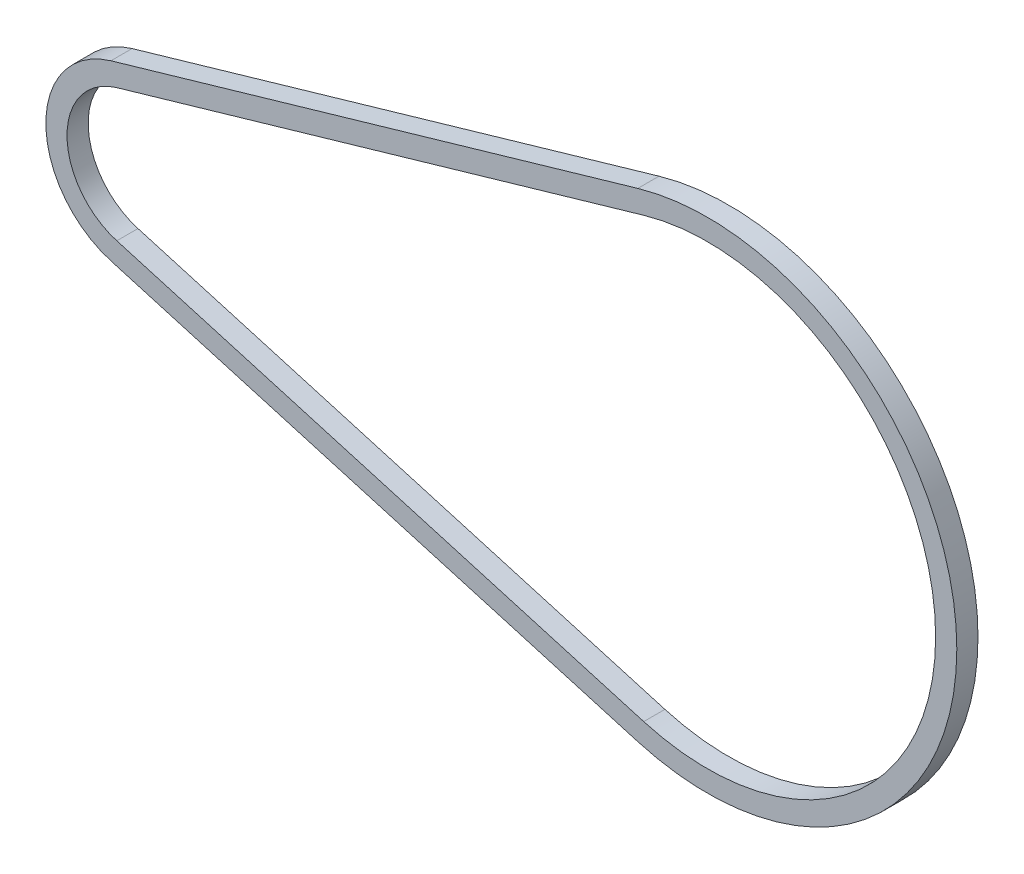
ISO-10303-21;
HEADER;
FILE_DESCRIPTION(('STEP AP214'),'2;1');
FILE_NAME('part.step','',(''),(''),'','','');
FILE_SCHEMA(('AUTOMOTIVE_DESIGN { 1 0 10303 214 1 1 1 1 }'));
ENDSEC;
DATA;
#1=APPLICATION_CONTEXT('core data for automotive mechanical design processes');
#2=APPLICATION_PROTOCOL_DEFINITION('international standard','automotive_design',2000,#1);
#3=PRODUCT_CONTEXT('',#1,'mechanical');
#4=PRODUCT('Part','Part','',(#3));
#5=PRODUCT_RELATED_PRODUCT_CATEGORY('part','',(#4));
#6=PRODUCT_DEFINITION_FORMATION('','',#4);
#7=PRODUCT_DEFINITION_CONTEXT('part definition',#1,'design');
#8=PRODUCT_DEFINITION('design','',#6,#7);
#9=PRODUCT_DEFINITION_SHAPE('','',#8);
#10=(LENGTH_UNIT() NAMED_UNIT(*) SI_UNIT(.MILLI.,.METRE.));
#11=(NAMED_UNIT(*) PLANE_ANGLE_UNIT() SI_UNIT($,.RADIAN.));
#12=(NAMED_UNIT(*) SI_UNIT($,.STERADIAN.) SOLID_ANGLE_UNIT());
#13=UNCERTAINTY_MEASURE_WITH_UNIT(LENGTH_MEASURE(1.E-05),#10,'distance_accuracy_value','');
#14=(GEOMETRIC_REPRESENTATION_CONTEXT(3) GLOBAL_UNCERTAINTY_ASSIGNED_CONTEXT((#13)) GLOBAL_UNIT_ASSIGNED_CONTEXT((#10,
#11,#12)) REPRESENTATION_CONTEXT('',''));
#15=CARTESIAN_POINT('',(0.,0.,0.));
#16=DIRECTION('',(0.,0.,1.));
#17=DIRECTION('',(1.,0.,0.));
#18=AXIS2_PLACEMENT_3D('',#15,#16,#17);
#19=CARTESIAN_POINT('',(0.,0.,1.27));
#20=DIRECTION('',(0.,0.,1.));
#21=DIRECTION('',(1.,0.,0.));
#22=AXIS2_PLACEMENT_3D('',#19,#20,#21);
#23=PLANE('',#22);
#24=CARTESIAN_POINT('',(0.,0.,1.27));
#25=DIRECTION('',(0.,0.,1.));
#26=DIRECTION('',(1.,0.,0.));
#27=AXIS2_PLACEMENT_3D('',#24,#25,#26);
#28=CIRCLE('',#27,10.8192968910912);
#29=CARTESIAN_POINT('',(-3.01580148803557,10.3904825009399,1.27));
#30=VERTEX_POINT('',#29);
#31=CARTESIAN_POINT('',(-3.01580148803557,-10.3904825009399,1.27));
#32=VERTEX_POINT('',#31);
#33=EDGE_CURVE('E177',#30,#32,#28,.T.);
#34=ORIENTED_EDGE('',*,*,#33,.T.);
#35=DIRECTION('',(0.960365780284263,-0.278742834991323,0.));
#36=VECTOR('',#35,1.);
#37=CARTESIAN_POINT('',(-3.01580148803557,-10.3904825009399,1.27));
#38=LINE('',#37,#36);
#39=CARTESIAN_POINT('',(60.1774981442526,-28.7321184208977,1.27));
#40=VERTEX_POINT('',#39);
#41=EDGE_CURVE('E181',#32,#40,#38,.T.);
#42=ORIENTED_EDGE('',*,*,#41,.T.);
#43=CARTESIAN_POINT('',(68.5168958074813,0.,1.27));
#44=DIRECTION('',(0.,0.,1.));
#45=DIRECTION('',(1.,0.,0.));
#46=AXIS2_PLACEMENT_3D('',#43,#44,#45);
#47=CIRCLE('',#46,29.9178906732736);
#48=CARTESIAN_POINT('',(60.1774981442526,28.7321184208977,1.27));
#49=VERTEX_POINT('',#48);
#50=EDGE_CURVE('E185',#40,#49,#47,.T.);
#51=ORIENTED_EDGE('',*,*,#50,.T.);
#52=DIRECTION('',(-0.960365780284263,-0.278742834991323,0.));
#53=VECTOR('',#52,1.);
#54=CARTESIAN_POINT('',(-3.01580148803557,10.3904825009399,1.27));
#55=LINE('',#54,#53);
#56=EDGE_CURVE('E188',#49,#30,#55,.T.);
#57=ORIENTED_EDGE('',*,*,#56,.T.);
#58=EDGE_LOOP('',(#34,#42,#51,#57));
#59=FACE_BOUND('',#58,.T.);
#60=DIRECTION('',(0.960365780284263,-0.278742834991323,0.));
#61=VECTOR('',#60,1.);
#62=CARTESIAN_POINT('',(-2.30779468715761,-7.95115341901787,1.27));
#63=LINE('',#62,#61);
#64=CARTESIAN_POINT('',(-2.30779468715761,-7.95115341901787,1.27));
#65=VERTEX_POINT('',#64);
#66=CARTESIAN_POINT('',(60.8855049451305,-26.2927893389757,1.27));
#67=VERTEX_POINT('',#66);
#68=EDGE_CURVE('E138',#65,#67,#63,.T.);
#69=ORIENTED_EDGE('',*,*,#68,.F.);
#70=CARTESIAN_POINT('',(0.,0.,1.27));
#71=DIRECTION('',(0.,0.,1.));
#72=DIRECTION('',(1.,0.,0.));
#73=AXIS2_PLACEMENT_3D('',#70,#71,#72);
#74=CIRCLE('',#73,8.2792968910912);
#75=CARTESIAN_POINT('',(-2.30779468715761,7.95115341901787,1.27));
#76=VERTEX_POINT('',#75);
#77=EDGE_CURVE('E129',#76,#65,#74,.T.);
#78=ORIENTED_EDGE('',*,*,#77,.F.);
#79=DIRECTION('',(-0.960365780284263,-0.278742834991323,0.));
#80=VECTOR('',#79,1.);
#81=CARTESIAN_POINT('',(-2.30779468715761,7.95115341901787,1.27));
#82=LINE('',#81,#80);
#83=CARTESIAN_POINT('',(60.8855049451305,26.2927893389757,1.27));
#84=VERTEX_POINT('',#83);
#85=EDGE_CURVE('E155',#84,#76,#82,.T.);
#86=ORIENTED_EDGE('',*,*,#85,.F.);
#87=CARTESIAN_POINT('',(68.5168958074813,0.,1.27));
#88=DIRECTION('',(0.,0.,1.));
#89=DIRECTION('',(1.,0.,0.));
#90=AXIS2_PLACEMENT_3D('',#87,#88,#89);
#91=CIRCLE('',#90,27.3778906732736);
#92=EDGE_CURVE('E151',#67,#84,#91,.T.);
#93=ORIENTED_EDGE('',*,*,#92,.F.);
#94=EDGE_LOOP('',(#69,#78,#86,#93));
#95=FACE_BOUND('',#94,.T.);
#96=ADVANCED_FACE('F63',(#59,#95),#23,.T.);
#97=CARTESIAN_POINT('',(0.,0.,-1.27));
#98=DIRECTION('',(0.,0.,1.));
#99=DIRECTION('',(1.,0.,0.));
#100=AXIS2_PLACEMENT_3D('',#97,#98,#99);
#101=PLANE('',#100);
#102=CARTESIAN_POINT('',(0.,0.,-1.27));
#103=DIRECTION('',(0.,0.,1.));
#104=DIRECTION('',(1.,0.,0.));
#105=AXIS2_PLACEMENT_3D('',#102,#103,#104);
#106=CIRCLE('',#105,10.8192968910912);
#107=CARTESIAN_POINT('',(-3.01580148803557,10.3904825009399,-1.27));
#108=VERTEX_POINT('',#107);
#109=CARTESIAN_POINT('',(-3.01580148803557,-10.3904825009399,-1.27));
#110=VERTEX_POINT('',#109);
#111=EDGE_CURVE('E147',#108,#110,#106,.T.);
#112=ORIENTED_EDGE('',*,*,#111,.F.);
#113=DIRECTION('',(-0.960365780284263,-0.278742834991323,0.));
#114=VECTOR('',#113,1.);
#115=CARTESIAN_POINT('',(-3.01580148803557,10.3904825009399,-1.27));
#116=LINE('',#115,#114);
#117=CARTESIAN_POINT('',(60.1774981442526,28.7321184208977,-1.27));
#118=VERTEX_POINT('',#117);
#119=EDGE_CURVE('E182',#118,#108,#116,.T.);
#120=ORIENTED_EDGE('',*,*,#119,.F.);
#121=CARTESIAN_POINT('',(68.5168958074813,0.,-1.27));
#122=DIRECTION('',(0.,0.,1.));
#123=DIRECTION('',(1.,0.,0.));
#124=AXIS2_PLACEMENT_3D('',#121,#122,#123);
#125=CIRCLE('',#124,29.9178906732736);
#126=CARTESIAN_POINT('',(60.1774981442526,-28.7321184208977,-1.27));
#127=VERTEX_POINT('',#126);
#128=EDGE_CURVE('E198',#127,#118,#125,.T.);
#129=ORIENTED_EDGE('',*,*,#128,.F.);
#130=DIRECTION('',(0.960365780284263,-0.278742834991323,0.));
#131=VECTOR('',#130,1.);
#132=CARTESIAN_POINT('',(-3.01580148803557,-10.3904825009399,-1.27));
#133=LINE('',#132,#131);
#134=EDGE_CURVE('E195',#110,#127,#133,.T.);
#135=ORIENTED_EDGE('',*,*,#134,.F.);
#136=EDGE_LOOP('',(#112,#120,#129,#135));
#137=FACE_BOUND('',#136,.T.);
#138=CARTESIAN_POINT('',(0.,0.,-1.27));
#139=DIRECTION('',(0.,0.,1.));
#140=DIRECTION('',(1.,0.,0.));
#141=AXIS2_PLACEMENT_3D('',#138,#139,#140);
#142=CIRCLE('',#141,8.2792968910912);
#143=CARTESIAN_POINT('',(-2.30779468715761,7.95115341901787,-1.27));
#144=VERTEX_POINT('',#143);
#145=CARTESIAN_POINT('',(-2.30779468715761,-7.95115341901787,-1.27));
#146=VERTEX_POINT('',#145);
#147=EDGE_CURVE('E87',#144,#146,#142,.T.);
#148=ORIENTED_EDGE('',*,*,#147,.T.);
#149=DIRECTION('',(0.960365780284263,-0.278742834991323,0.));
#150=VECTOR('',#149,1.);
#151=CARTESIAN_POINT('',(-2.30779468715761,-7.95115341901787,-1.27));
#152=LINE('',#151,#150);
#153=CARTESIAN_POINT('',(60.8855049451305,-26.2927893389757,-1.27));
#154=VERTEX_POINT('',#153);
#155=EDGE_CURVE('E145',#146,#154,#152,.T.);
#156=ORIENTED_EDGE('',*,*,#155,.T.);
#157=CARTESIAN_POINT('',(68.5168958074813,0.,-1.27));
#158=DIRECTION('',(0.,0.,1.));
#159=DIRECTION('',(1.,0.,0.));
#160=AXIS2_PLACEMENT_3D('',#157,#158,#159);
#161=CIRCLE('',#160,27.3778906732736);
#162=CARTESIAN_POINT('',(60.8855049451305,26.2927893389757,-1.27));
#163=VERTEX_POINT('',#162);
#164=EDGE_CURVE('E164',#154,#163,#161,.T.);
#165=ORIENTED_EDGE('',*,*,#164,.T.);
#166=DIRECTION('',(-0.960365780284263,-0.278742834991323,0.));
#167=VECTOR('',#166,1.);
#168=CARTESIAN_POINT('',(-2.30779468715761,7.95115341901787,-1.27));
#169=LINE('',#168,#167);
#170=EDGE_CURVE('E139',#163,#144,#169,.T.);
#171=ORIENTED_EDGE('',*,*,#170,.T.);
#172=EDGE_LOOP('',(#148,#156,#165,#171));
#173=FACE_BOUND('',#172,.T.);
#174=ADVANCED_FACE('F221',(#137,#173),#101,.F.);
#175=CARTESIAN_POINT('',(0.,0.,1.27));
#176=DIRECTION('',(0.,0.,-1.));
#177=DIRECTION('',(-1.,0.,0.));
#178=AXIS2_PLACEMENT_3D('',#175,#176,#177);
#179=CYLINDRICAL_SURFACE('',#178,10.8192968910912);
#180=ORIENTED_EDGE('',*,*,#111,.T.);
#181=DIRECTION('',(0.,0.,-1.));
#182=VECTOR('',#181,1.);
#183=CARTESIAN_POINT('',(-3.01580148803557,-10.3904825009399,1.27));
#184=LINE('',#183,#182);
#185=EDGE_CURVE('E12',#32,#110,#184,.T.);
#186=ORIENTED_EDGE('',*,*,#185,.F.);
#187=ORIENTED_EDGE('',*,*,#33,.F.);
#188=DIRECTION('',(0.,0.,-1.));
#189=VECTOR('',#188,1.);
#190=CARTESIAN_POINT('',(-3.01580148803557,10.3904825009399,1.27));
#191=LINE('',#190,#189);
#192=EDGE_CURVE('E191',#30,#108,#191,.T.);
#193=ORIENTED_EDGE('',*,*,#192,.T.);
#194=EDGE_LOOP('',(#180,#186,#187,#193));
#195=FACE_BOUND('',#194,.T.);
#196=ADVANCED_FACE('F65',(#195),#179,.T.);
#197=CARTESIAN_POINT('',(-3.01580148803557,-10.3904825009399,1.27));
#198=DIRECTION('',(0.278742834991323,0.960365780284262,0.));
#199=DIRECTION('',(-0.960365780284263,0.278742834991323,0.));
#200=AXIS2_PLACEMENT_3D('',#197,#198,#199);
#201=PLANE('',#200);
#202=ORIENTED_EDGE('',*,*,#134,.T.);
#203=DIRECTION('',(0.,0.,-1.));
#204=VECTOR('',#203,1.);
#205=CARTESIAN_POINT('',(60.1774981442526,-28.7321184208977,1.27));
#206=LINE('',#205,#204);
#207=EDGE_CURVE('E72',#40,#127,#206,.T.);
#208=ORIENTED_EDGE('',*,*,#207,.F.);
#209=ORIENTED_EDGE('',*,*,#41,.F.);
#210=ORIENTED_EDGE('',*,*,#185,.T.);
#211=EDGE_LOOP('',(#202,#208,#209,#210));
#212=FACE_BOUND('',#211,.T.);
#213=ADVANCED_FACE('F231',(#212),#201,.F.);
#214=CARTESIAN_POINT('',(68.5168958074813,0.,1.27));
#215=DIRECTION('',(0.,0.,-1.));
#216=DIRECTION('',(-1.,0.,0.));
#217=AXIS2_PLACEMENT_3D('',#214,#215,#216);
#218=CYLINDRICAL_SURFACE('',#217,29.9178906732736);
#219=ORIENTED_EDGE('',*,*,#128,.T.);
#220=DIRECTION('',(0.,0.,-1.));
#221=VECTOR('',#220,1.);
#222=CARTESIAN_POINT('',(60.1774981442526,28.7321184208977,1.27));
#223=LINE('',#222,#221);
#224=EDGE_CURVE('E206',#49,#118,#223,.T.);
#225=ORIENTED_EDGE('',*,*,#224,.F.);
#226=ORIENTED_EDGE('',*,*,#50,.F.);
#227=ORIENTED_EDGE('',*,*,#207,.T.);
#228=EDGE_LOOP('',(#219,#225,#226,#227));
#229=FACE_BOUND('',#228,.T.);
#230=ADVANCED_FACE('F215',(#229),#218,.T.);
#231=CARTESIAN_POINT('',(-3.01580148803557,10.3904825009399,1.27));
#232=DIRECTION('',(0.278742834991323,-0.960365780284262,0.));
#233=DIRECTION('',(0.960365780284263,0.278742834991323,0.));
#234=AXIS2_PLACEMENT_3D('',#231,#232,#233);
#235=PLANE('',#234);
#236=ORIENTED_EDGE('',*,*,#119,.T.);
#237=ORIENTED_EDGE('',*,*,#192,.F.);
#238=ORIENTED_EDGE('',*,*,#56,.F.);
#239=ORIENTED_EDGE('',*,*,#224,.T.);
#240=EDGE_LOOP('',(#236,#237,#238,#239));
#241=FACE_BOUND('',#240,.T.);
#242=ADVANCED_FACE('F225',(#241),#235,.F.);
#243=CARTESIAN_POINT('',(0.,0.,1.27));
#244=DIRECTION('',(0.,0.,-1.));
#245=DIRECTION('',(-1.,0.,0.));
#246=AXIS2_PLACEMENT_3D('',#243,#244,#245);
#247=CYLINDRICAL_SURFACE('',#246,8.2792968910912);
#248=ORIENTED_EDGE('',*,*,#147,.F.);
#249=DIRECTION('',(0.,0.,-1.));
#250=VECTOR('',#249,1.);
#251=CARTESIAN_POINT('',(-2.30779468715761,7.95115341901787,1.27));
#252=LINE('',#251,#250);
#253=EDGE_CURVE('E133',#76,#144,#252,.T.);
#254=ORIENTED_EDGE('',*,*,#253,.F.);
#255=ORIENTED_EDGE('',*,*,#77,.T.);
#256=DIRECTION('',(0.,0.,-1.));
#257=VECTOR('',#256,1.);
#258=CARTESIAN_POINT('',(-2.30779468715761,-7.95115341901787,1.27));
#259=LINE('',#258,#257);
#260=EDGE_CURVE('E132',#65,#146,#259,.T.);
#261=ORIENTED_EDGE('',*,*,#260,.T.);
#262=EDGE_LOOP('',(#248,#254,#255,#261));
#263=FACE_BOUND('',#262,.T.);
#264=ADVANCED_FACE('F131',(#263),#247,.F.);
#265=CARTESIAN_POINT('',(-2.30779468715761,-7.95115341901787,1.27));
#266=DIRECTION('',(0.278742834991323,0.960365780284262,0.));
#267=DIRECTION('',(-0.960365780284263,0.278742834991323,0.));
#268=AXIS2_PLACEMENT_3D('',#265,#266,#267);
#269=PLANE('',#268);
#270=ORIENTED_EDGE('',*,*,#155,.F.);
#271=ORIENTED_EDGE('',*,*,#260,.F.);
#272=ORIENTED_EDGE('',*,*,#68,.T.);
#273=DIRECTION('',(0.,0.,-1.));
#274=VECTOR('',#273,1.);
#275=CARTESIAN_POINT('',(60.8855049451305,-26.2927893389757,1.27));
#276=LINE('',#275,#274);
#277=EDGE_CURVE('E148',#67,#154,#276,.T.);
#278=ORIENTED_EDGE('',*,*,#277,.T.);
#279=EDGE_LOOP('',(#270,#271,#272,#278));
#280=FACE_BOUND('',#279,.T.);
#281=ADVANCED_FACE('F142',(#280),#269,.T.);
#282=CARTESIAN_POINT('',(68.5168958074813,0.,1.27));
#283=DIRECTION('',(0.,0.,-1.));
#284=DIRECTION('',(-1.,0.,0.));
#285=AXIS2_PLACEMENT_3D('',#282,#283,#284);
#286=CYLINDRICAL_SURFACE('',#285,27.3778906732736);
#287=ORIENTED_EDGE('',*,*,#164,.F.);
#288=ORIENTED_EDGE('',*,*,#277,.F.);
#289=ORIENTED_EDGE('',*,*,#92,.T.);
#290=DIRECTION('',(0.,0.,-1.));
#291=VECTOR('',#290,1.);
#292=CARTESIAN_POINT('',(60.8855049451305,26.2927893389757,1.27));
#293=LINE('',#292,#291);
#294=EDGE_CURVE('E79',#84,#163,#293,.T.);
#295=ORIENTED_EDGE('',*,*,#294,.T.);
#296=EDGE_LOOP('',(#287,#288,#289,#295));
#297=FACE_BOUND('',#296,.T.);
#298=ADVANCED_FACE('F254',(#297),#286,.F.);
#299=CARTESIAN_POINT('',(-2.30779468715761,7.95115341901787,1.27));
#300=DIRECTION('',(0.278742834991323,-0.960365780284262,0.));
#301=DIRECTION('',(0.960365780284263,0.278742834991323,0.));
#302=AXIS2_PLACEMENT_3D('',#299,#300,#301);
#303=PLANE('',#302);
#304=ORIENTED_EDGE('',*,*,#170,.F.);
#305=ORIENTED_EDGE('',*,*,#294,.F.);
#306=ORIENTED_EDGE('',*,*,#85,.T.);
#307=ORIENTED_EDGE('',*,*,#253,.T.);
#308=EDGE_LOOP('',(#304,#305,#306,#307));
#309=FACE_BOUND('',#308,.T.);
#310=ADVANCED_FACE('F258',(#309),#303,.T.);
#311=CLOSED_SHELL('',(#96,#174,#196,#213,#230,#242,#264,#281,#298,#310));
#312=MANIFOLD_SOLID_BREP('B2',#311);
#313=ADVANCED_BREP_SHAPE_REPRESENTATION('',(#18,#312),#14);
#314=SHAPE_DEFINITION_REPRESENTATION(#9,#313);
ENDSEC;
END-ISO-10303-21;
